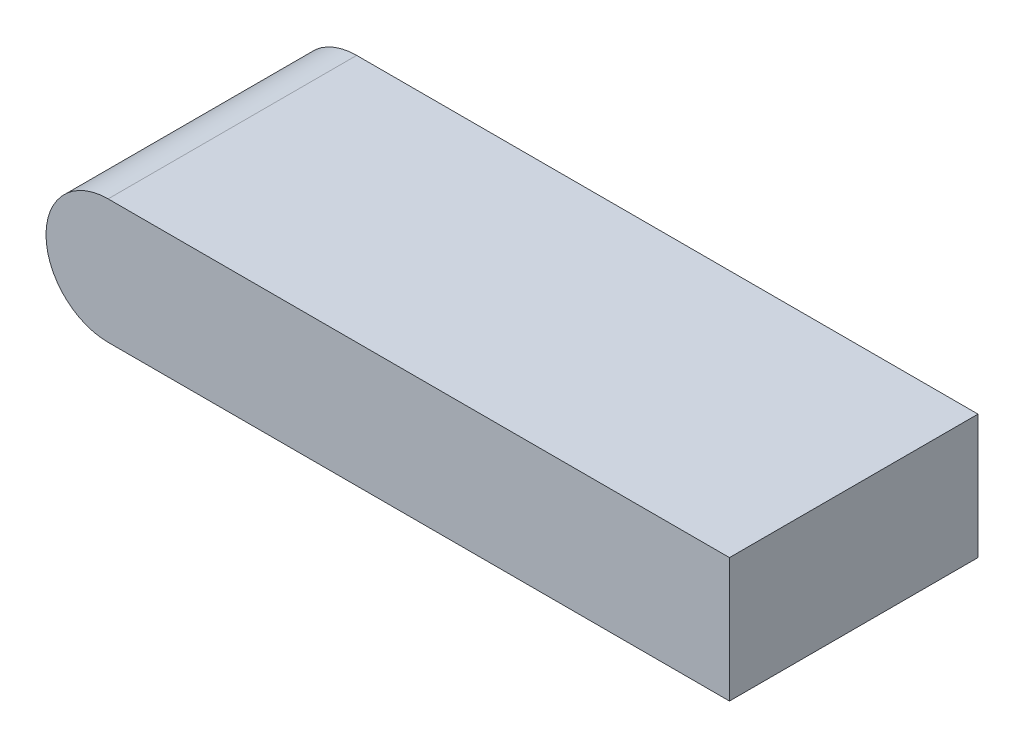
ISO-10303-21;
HEADER;
FILE_DESCRIPTION(('STEP AP214'),'2;1');
FILE_NAME('part.step','',(''),(''),'','','');
FILE_SCHEMA(('AUTOMOTIVE_DESIGN { 1 0 10303 214 1 1 1 1 }'));
ENDSEC;
DATA;
#1=APPLICATION_CONTEXT('core data for automotive mechanical design processes');
#2=APPLICATION_PROTOCOL_DEFINITION('international standard','automotive_design',2000,#1);
#3=PRODUCT_CONTEXT('',#1,'mechanical');
#4=PRODUCT('Part','Part','',(#3));
#5=PRODUCT_RELATED_PRODUCT_CATEGORY('part','',(#4));
#6=PRODUCT_DEFINITION_FORMATION('','',#4);
#7=PRODUCT_DEFINITION_CONTEXT('part definition',#1,'design');
#8=PRODUCT_DEFINITION('design','',#6,#7);
#9=PRODUCT_DEFINITION_SHAPE('','',#8);
#10=(LENGTH_UNIT() NAMED_UNIT(*) SI_UNIT(.MILLI.,.METRE.));
#11=(NAMED_UNIT(*) PLANE_ANGLE_UNIT() SI_UNIT($,.RADIAN.));
#12=(NAMED_UNIT(*) SI_UNIT($,.STERADIAN.) SOLID_ANGLE_UNIT());
#13=UNCERTAINTY_MEASURE_WITH_UNIT(LENGTH_MEASURE(1.E-05),#10,'distance_accuracy_value','');
#14=(GEOMETRIC_REPRESENTATION_CONTEXT(3) GLOBAL_UNCERTAINTY_ASSIGNED_CONTEXT((#13)) GLOBAL_UNIT_ASSIGNED_CONTEXT((#10,
#11,#12)) REPRESENTATION_CONTEXT('',''));
#15=CARTESIAN_POINT('',(0.,0.,0.));
#16=DIRECTION('',(0.,0.,1.));
#17=DIRECTION('',(1.,0.,0.));
#18=AXIS2_PLACEMENT_3D('',#15,#16,#17);
#19=CARTESIAN_POINT('',(-10.,4.,4.));
#20=DIRECTION('',(0.,0.,-1.));
#21=DIRECTION('',(-1.,0.,0.));
#22=AXIS2_PLACEMENT_3D('',#19,#20,#21);
#23=PLANE('',#22);
#24=DIRECTION('',(1.,0.,0.));
#25=VECTOR('',#24,1.);
#26=CARTESIAN_POINT('',(-10.,4.,4.));
#27=LINE('',#26,#25);
#28=CARTESIAN_POINT('',(-10.,4.,4.));
#29=VERTEX_POINT('',#28);
#30=CARTESIAN_POINT('',(10.,4.,4.));
#31=VERTEX_POINT('',#30);
#32=EDGE_CURVE('E79',#29,#31,#27,.T.);
#33=ORIENTED_EDGE('',*,*,#32,.F.);
#34=CARTESIAN_POINT('',(-10.,2.,4.));
#35=DIRECTION('',(0.,0.,1.));
#36=DIRECTION('',(1.,0.,0.));
#37=AXIS2_PLACEMENT_3D('',#34,#35,#36);
#38=CIRCLE('',#37,2.);
#39=CARTESIAN_POINT('',(-10.,0.,4.));
#40=VERTEX_POINT('',#39);
#41=EDGE_CURVE('E92',#29,#40,#38,.T.);
#42=ORIENTED_EDGE('',*,*,#41,.T.);
#43=DIRECTION('',(1.,0.,0.));
#44=VECTOR('',#43,1.);
#45=CARTESIAN_POINT('',(-10.,0.,4.));
#46=LINE('',#45,#44);
#47=CARTESIAN_POINT('',(10.,0.,4.));
#48=VERTEX_POINT('',#47);
#49=EDGE_CURVE('E83',#40,#48,#46,.T.);
#50=ORIENTED_EDGE('',*,*,#49,.T.);
#51=DIRECTION('',(0.,-1.,0.));
#52=VECTOR('',#51,1.);
#53=CARTESIAN_POINT('',(10.,4.,4.));
#54=LINE('',#53,#52);
#55=EDGE_CURVE('E11',#31,#48,#54,.T.);
#56=ORIENTED_EDGE('',*,*,#55,.F.);
#57=EDGE_LOOP('',(#33,#42,#50,#56));
#58=FACE_BOUND('',#57,.T.);
#59=ADVANCED_FACE('F34',(#58),#23,.F.);
#60=CARTESIAN_POINT('',(10.,4.,-4.));
#61=DIRECTION('',(-1.,0.,0.));
#62=DIRECTION('',(0.,0.,1.));
#63=AXIS2_PLACEMENT_3D('',#60,#61,#62);
#64=PLANE('',#63);
#65=DIRECTION('',(0.,0.,-1.));
#66=VECTOR('',#65,1.);
#67=CARTESIAN_POINT('',(10.,0.,-4.));
#68=LINE('',#67,#66);
#69=CARTESIAN_POINT('',(10.,0.,-4.));
#70=VERTEX_POINT('',#69);
#71=EDGE_CURVE('E64',#48,#70,#68,.T.);
#72=ORIENTED_EDGE('',*,*,#71,.T.);
#73=DIRECTION('',(0.,-1.,0.));
#74=VECTOR('',#73,1.);
#75=CARTESIAN_POINT('',(10.,4.,-4.));
#76=LINE('',#75,#74);
#77=CARTESIAN_POINT('',(10.,4.,-4.));
#78=VERTEX_POINT('',#77);
#79=EDGE_CURVE('E42',#78,#70,#76,.T.);
#80=ORIENTED_EDGE('',*,*,#79,.F.);
#81=DIRECTION('',(0.,0.,-1.));
#82=VECTOR('',#81,1.);
#83=CARTESIAN_POINT('',(10.,4.,-4.));
#84=LINE('',#83,#82);
#85=EDGE_CURVE('E101',#31,#78,#84,.T.);
#86=ORIENTED_EDGE('',*,*,#85,.F.);
#87=ORIENTED_EDGE('',*,*,#55,.T.);
#88=EDGE_LOOP('',(#72,#80,#86,#87));
#89=FACE_BOUND('',#88,.T.);
#90=ADVANCED_FACE('F107',(#89),#64,.F.);
#91=CARTESIAN_POINT('',(-10.,4.,-4.));
#92=DIRECTION('',(0.,0.,1.));
#93=DIRECTION('',(1.,0.,0.));
#94=AXIS2_PLACEMENT_3D('',#91,#92,#93);
#95=PLANE('',#94);
#96=DIRECTION('',(-1.,0.,0.));
#97=VECTOR('',#96,1.);
#98=CARTESIAN_POINT('',(-10.,0.,-4.));
#99=LINE('',#98,#97);
#100=CARTESIAN_POINT('',(-10.,0.,-4.));
#101=VERTEX_POINT('',#100);
#102=EDGE_CURVE('E71',#70,#101,#99,.T.);
#103=ORIENTED_EDGE('',*,*,#102,.T.);
#104=CARTESIAN_POINT('',(-10.,2.,-4.));
#105=DIRECTION('',(0.,0.,1.));
#106=DIRECTION('',(1.,0.,0.));
#107=AXIS2_PLACEMENT_3D('',#104,#105,#106);
#108=CIRCLE('',#107,2.);
#109=CARTESIAN_POINT('',(-10.,4.,-4.));
#110=VERTEX_POINT('',#109);
#111=EDGE_CURVE('E93',#110,#101,#108,.T.);
#112=ORIENTED_EDGE('',*,*,#111,.F.);
#113=DIRECTION('',(-1.,0.,0.));
#114=VECTOR('',#113,1.);
#115=CARTESIAN_POINT('',(-10.,4.,-4.));
#116=LINE('',#115,#114);
#117=EDGE_CURVE('E50',#78,#110,#116,.T.);
#118=ORIENTED_EDGE('',*,*,#117,.F.);
#119=ORIENTED_EDGE('',*,*,#79,.T.);
#120=EDGE_LOOP('',(#103,#112,#118,#119));
#121=FACE_BOUND('',#120,.T.);
#122=ADVANCED_FACE('F105',(#121),#95,.F.);
#123=CARTESIAN_POINT('',(0.,4.,0.));
#124=DIRECTION('',(0.,1.,0.));
#125=DIRECTION('',(0.,0.,1.));
#126=AXIS2_PLACEMENT_3D('',#123,#124,#125);
#127=PLANE('',#126);
#128=DIRECTION('',(0.,0.,1.));
#129=VECTOR('',#128,1.);
#130=CARTESIAN_POINT('',(-10.,4.,-4.));
#131=LINE('',#130,#129);
#132=EDGE_CURVE('E98',#110,#29,#131,.T.);
#133=ORIENTED_EDGE('',*,*,#132,.T.);
#134=ORIENTED_EDGE('',*,*,#32,.T.);
#135=ORIENTED_EDGE('',*,*,#85,.T.);
#136=ORIENTED_EDGE('',*,*,#117,.T.);
#137=EDGE_LOOP('',(#133,#134,#135,#136));
#138=FACE_BOUND('',#137,.T.);
#139=ADVANCED_FACE('F108',(#138),#127,.T.);
#140=CARTESIAN_POINT('',(0.,0.,0.));
#141=DIRECTION('',(0.,1.,0.));
#142=DIRECTION('',(0.,0.,1.));
#143=AXIS2_PLACEMENT_3D('',#140,#141,#142);
#144=PLANE('',#143);
#145=DIRECTION('',(0.,0.,1.));
#146=VECTOR('',#145,1.);
#147=CARTESIAN_POINT('',(-10.,0.,-4.));
#148=LINE('',#147,#146);
#149=EDGE_CURVE('E86',#101,#40,#148,.T.);
#150=ORIENTED_EDGE('',*,*,#149,.F.);
#151=ORIENTED_EDGE('',*,*,#102,.F.);
#152=ORIENTED_EDGE('',*,*,#71,.F.);
#153=ORIENTED_EDGE('',*,*,#49,.F.);
#154=EDGE_LOOP('',(#150,#151,#152,#153));
#155=FACE_BOUND('',#154,.T.);
#156=ADVANCED_FACE('F85',(#155),#144,.F.);
#157=CARTESIAN_POINT('',(-10.,2.,-4.));
#158=DIRECTION('',(0.,0.,1.));
#159=DIRECTION('',(1.,0.,0.));
#160=AXIS2_PLACEMENT_3D('',#157,#158,#159);
#161=CYLINDRICAL_SURFACE('',#160,2.);
#162=ORIENTED_EDGE('',*,*,#132,.F.);
#163=ORIENTED_EDGE('',*,*,#111,.T.);
#164=ORIENTED_EDGE('',*,*,#149,.T.);
#165=ORIENTED_EDGE('',*,*,#41,.F.);
#166=EDGE_LOOP('',(#162,#163,#164,#165));
#167=FACE_BOUND('',#166,.T.);
#168=ADVANCED_FACE('F91',(#167),#161,.T.);
#169=CLOSED_SHELL('',(#59,#90,#122,#139,#156,#168));
#170=MANIFOLD_SOLID_BREP('B2',#169);
#171=ADVANCED_BREP_SHAPE_REPRESENTATION('',(#18,#170),#14);
#172=SHAPE_DEFINITION_REPRESENTATION(#9,#171);
ENDSEC;
END-ISO-10303-21;
